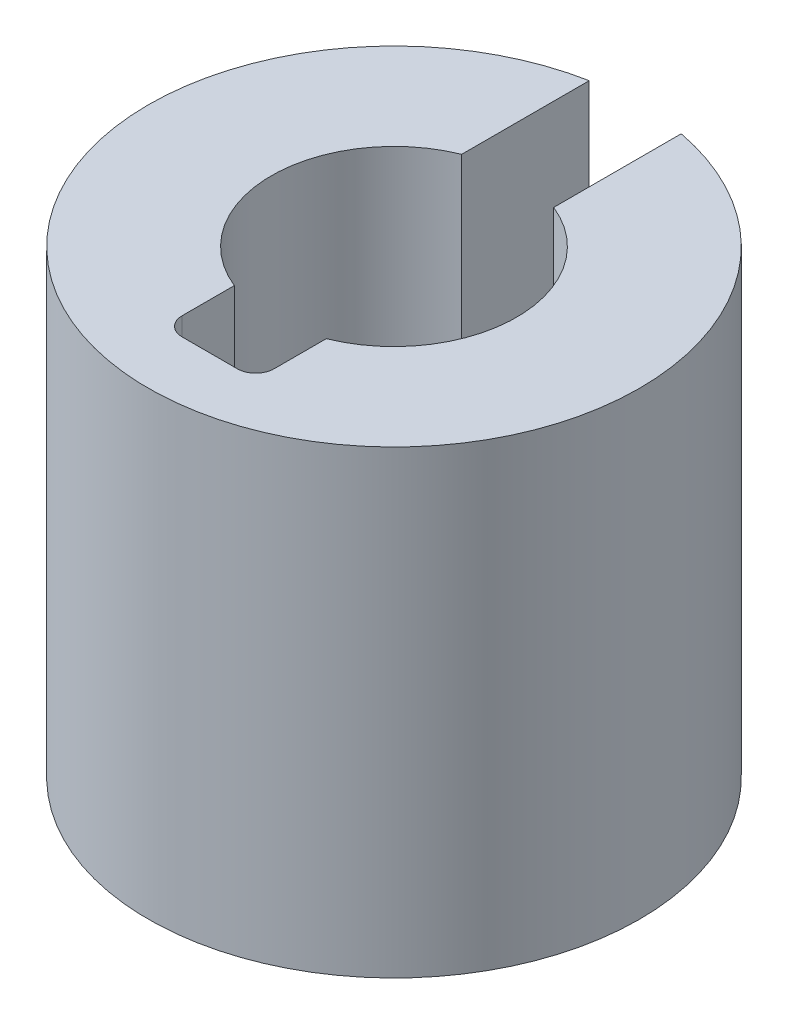
ISO-10303-21;
HEADER;
FILE_DESCRIPTION(('STEP AP214'),'2;1');
FILE_NAME('part.step','',(''),(''),'','','');
FILE_SCHEMA(('AUTOMOTIVE_DESIGN { 1 0 10303 214 1 1 1 1 }'));
ENDSEC;
DATA;
#1=APPLICATION_CONTEXT('core data for automotive mechanical design processes');
#2=APPLICATION_PROTOCOL_DEFINITION('international standard','automotive_design',2000,#1);
#3=PRODUCT_CONTEXT('',#1,'mechanical');
#4=PRODUCT('Part','Part','',(#3));
#5=PRODUCT_RELATED_PRODUCT_CATEGORY('part','',(#4));
#6=PRODUCT_DEFINITION_FORMATION('','',#4);
#7=PRODUCT_DEFINITION_CONTEXT('part definition',#1,'design');
#8=PRODUCT_DEFINITION('design','',#6,#7);
#9=PRODUCT_DEFINITION_SHAPE('','',#8);
#10=(LENGTH_UNIT() NAMED_UNIT(*) SI_UNIT(.MILLI.,.METRE.));
#11=(NAMED_UNIT(*) PLANE_ANGLE_UNIT() SI_UNIT($,.RADIAN.));
#12=(NAMED_UNIT(*) SI_UNIT($,.STERADIAN.) SOLID_ANGLE_UNIT());
#13=UNCERTAINTY_MEASURE_WITH_UNIT(LENGTH_MEASURE(1.E-05),#10,'distance_accuracy_value','');
#14=(GEOMETRIC_REPRESENTATION_CONTEXT(3) GLOBAL_UNCERTAINTY_ASSIGNED_CONTEXT((#13)) GLOBAL_UNIT_ASSIGNED_CONTEXT((#10,
#11,#12)) REPRESENTATION_CONTEXT('',''));
#15=CARTESIAN_POINT('',(0.,0.,0.));
#16=DIRECTION('',(0.,0.,1.));
#17=DIRECTION('',(1.,0.,0.));
#18=AXIS2_PLACEMENT_3D('',#15,#16,#17);
#19=CARTESIAN_POINT('',(-0.75,3.75,3.005));
#20=DIRECTION('',(0.,0.,1.));
#21=DIRECTION('',(1.,0.,0.));
#22=AXIS2_PLACEMENT_3D('',#19,#20,#21);
#23=PLANE('',#22);
#24=DIRECTION('',(0.,1.,0.));
#25=VECTOR('',#24,1.);
#26=CARTESIAN_POINT('',(-0.45,3.75,3.005));
#27=LINE('',#26,#25);
#28=CARTESIAN_POINT('',(-0.45,-3.75,3.005));
#29=VERTEX_POINT('',#28);
#30=CARTESIAN_POINT('',(-0.45,3.75,3.005));
#31=VERTEX_POINT('',#30);
#32=EDGE_CURVE('E145',#29,#31,#27,.T.);
#33=ORIENTED_EDGE('',*,*,#32,.T.);
#34=DIRECTION('',(1.,0.,0.));
#35=VECTOR('',#34,1.);
#36=CARTESIAN_POINT('',(-0.75,3.75,3.005));
#37=LINE('',#36,#35);
#38=CARTESIAN_POINT('',(0.45,3.75,3.005));
#39=VERTEX_POINT('',#38);
#40=EDGE_CURVE('E124',#39,#31,#37,.F.);
#41=ORIENTED_EDGE('',*,*,#40,.F.);
#42=DIRECTION('',(0.,1.,0.));
#43=VECTOR('',#42,1.);
#44=CARTESIAN_POINT('',(0.45,3.75,3.005));
#45=LINE('',#44,#43);
#46=CARTESIAN_POINT('',(0.45,-3.75,3.005));
#47=VERTEX_POINT('',#46);
#48=EDGE_CURVE('E123',#39,#47,#45,.F.);
#49=ORIENTED_EDGE('',*,*,#48,.T.);
#50=DIRECTION('',(1.,0.,0.));
#51=VECTOR('',#50,1.);
#52=CARTESIAN_POINT('',(-0.75,-3.75,3.005));
#53=LINE('',#52,#51);
#54=EDGE_CURVE('E112',#29,#47,#53,.T.);
#55=ORIENTED_EDGE('',*,*,#54,.F.);
#56=EDGE_LOOP('',(#33,#41,#49,#55));
#57=FACE_BOUND('',#56,.T.);
#58=ADVANCED_FACE('F16',(#57),#23,.F.);
#59=CARTESIAN_POINT('',(0.45,3.75,2.705));
#60=DIRECTION('',(0.,1.,0.));
#61=DIRECTION('',(0.,0.,1.));
#62=AXIS2_PLACEMENT_3D('',#59,#60,#61);
#63=CYLINDRICAL_SURFACE('',#62,0.3);
#64=DIRECTION('',(0.,1.,0.));
#65=VECTOR('',#64,1.);
#66=CARTESIAN_POINT('',(0.75,3.75,2.705));
#67=LINE('',#66,#65);
#68=CARTESIAN_POINT('',(0.75,3.75,2.705));
#69=VERTEX_POINT('',#68);
#70=CARTESIAN_POINT('',(0.75,-3.75,2.705));
#71=VERTEX_POINT('',#70);
#72=EDGE_CURVE('E134',#69,#71,#67,.F.);
#73=ORIENTED_EDGE('',*,*,#72,.T.);
#74=CARTESIAN_POINT('',(0.45,-3.75,2.705));
#75=DIRECTION('',(0.,1.,0.));
#76=DIRECTION('',(0.,0.,1.));
#77=AXIS2_PLACEMENT_3D('',#74,#75,#76);
#78=CIRCLE('',#77,0.3);
#79=EDGE_CURVE('E19',#47,#71,#78,.T.);
#80=ORIENTED_EDGE('',*,*,#79,.F.);
#81=ORIENTED_EDGE('',*,*,#48,.F.);
#82=CARTESIAN_POINT('',(0.45,3.75,2.705));
#83=DIRECTION('',(0.,1.,0.));
#84=DIRECTION('',(0.,0.,1.));
#85=AXIS2_PLACEMENT_3D('',#82,#83,#84);
#86=CIRCLE('',#85,0.3);
#87=EDGE_CURVE('E137',#69,#39,#86,.F.);
#88=ORIENTED_EDGE('',*,*,#87,.F.);
#89=EDGE_LOOP('',(#73,#80,#81,#88));
#90=FACE_BOUND('',#89,.T.);
#91=ADVANCED_FACE('F132',(#90),#63,.F.);
#92=CARTESIAN_POINT('',(-0.45,3.75,2.705));
#93=DIRECTION('',(0.,1.,0.));
#94=DIRECTION('',(0.,0.,1.));
#95=AXIS2_PLACEMENT_3D('',#92,#93,#94);
#96=CYLINDRICAL_SURFACE('',#95,0.3);
#97=ORIENTED_EDGE('',*,*,#32,.F.);
#98=CARTESIAN_POINT('',(-0.45,-3.75,2.705));
#99=DIRECTION('',(0.,1.,0.));
#100=DIRECTION('',(0.,0.,1.));
#101=AXIS2_PLACEMENT_3D('',#98,#99,#100);
#102=CIRCLE('',#101,0.3);
#103=CARTESIAN_POINT('',(-0.75,-3.75,2.705));
#104=VERTEX_POINT('',#103);
#105=EDGE_CURVE('E118',#104,#29,#102,.T.);
#106=ORIENTED_EDGE('',*,*,#105,.F.);
#107=DIRECTION('',(0.,1.,0.));
#108=VECTOR('',#107,1.);
#109=CARTESIAN_POINT('',(-0.75,3.75,2.705));
#110=LINE('',#109,#108);
#111=CARTESIAN_POINT('',(-0.75,3.75,2.705));
#112=VERTEX_POINT('',#111);
#113=EDGE_CURVE('E183',#104,#112,#110,.T.);
#114=ORIENTED_EDGE('',*,*,#113,.T.);
#115=CARTESIAN_POINT('',(-0.45,3.75,2.705));
#116=DIRECTION('',(0.,1.,0.));
#117=DIRECTION('',(0.,0.,1.));
#118=AXIS2_PLACEMENT_3D('',#115,#116,#117);
#119=CIRCLE('',#118,0.3);
#120=EDGE_CURVE('E148',#31,#112,#119,.F.);
#121=ORIENTED_EDGE('',*,*,#120,.F.);
#122=EDGE_LOOP('',(#97,#106,#114,#121));
#123=FACE_BOUND('',#122,.T.);
#124=ADVANCED_FACE('F234',(#123),#96,.F.);
#125=CARTESIAN_POINT('',(0.75,3.75,3.005));
#126=DIRECTION('',(1.,0.,0.));
#127=DIRECTION('',(0.,0.,-1.));
#128=AXIS2_PLACEMENT_3D('',#125,#126,#127);
#129=PLANE('',#128);
#130=ORIENTED_EDGE('',*,*,#72,.F.);
#131=DIRECTION('',(0.,0.,-1.));
#132=VECTOR('',#131,1.);
#133=CARTESIAN_POINT('',(0.75,3.75,3.005));
#134=LINE('',#133,#132);
#135=CARTESIAN_POINT('',(0.75,3.75,1.85404962177392));
#136=VERTEX_POINT('',#135);
#137=EDGE_CURVE('E151',#136,#69,#134,.F.);
#138=ORIENTED_EDGE('',*,*,#137,.F.);
#139=DIRECTION('',(0.,-1.,0.));
#140=VECTOR('',#139,1.);
#141=CARTESIAN_POINT('',(0.75,3.75,1.85404962177392));
#142=LINE('',#141,#140);
#143=CARTESIAN_POINT('',(0.75,-3.75,1.85404962177392));
#144=VERTEX_POINT('',#143);
#145=EDGE_CURVE('E195',#136,#144,#142,.T.);
#146=ORIENTED_EDGE('',*,*,#145,.T.);
#147=DIRECTION('',(0.,0.,-1.));
#148=VECTOR('',#147,1.);
#149=CARTESIAN_POINT('',(0.75,-3.75,3.005));
#150=LINE('',#149,#148);
#151=EDGE_CURVE('E182',#71,#144,#150,.T.);
#152=ORIENTED_EDGE('',*,*,#151,.F.);
#153=EDGE_LOOP('',(#130,#138,#146,#152));
#154=FACE_BOUND('',#153,.T.);
#155=ADVANCED_FACE('F231',(#154),#129,.F.);
#156=CARTESIAN_POINT('',(-0.75,3.75,3.005));
#157=DIRECTION('',(-1.,0.,0.));
#158=DIRECTION('',(0.,0.,1.));
#159=AXIS2_PLACEMENT_3D('',#156,#157,#158);
#160=PLANE('',#159);
#161=ORIENTED_EDGE('',*,*,#113,.F.);
#162=DIRECTION('',(0.,0.,1.));
#163=VECTOR('',#162,1.);
#164=CARTESIAN_POINT('',(-0.75,-3.75,3.005));
#165=LINE('',#164,#163);
#166=CARTESIAN_POINT('',(-0.75,-3.75,1.85404962177392));
#167=VERTEX_POINT('',#166);
#168=EDGE_CURVE('E188',#167,#104,#165,.T.);
#169=ORIENTED_EDGE('',*,*,#168,.F.);
#170=DIRECTION('',(0.,-1.,0.));
#171=VECTOR('',#170,1.);
#172=CARTESIAN_POINT('',(-0.749999999999999,3.75,1.85404962177392));
#173=LINE('',#172,#171);
#174=CARTESIAN_POINT('',(-0.75,3.75,1.85404962177392));
#175=VERTEX_POINT('',#174);
#176=EDGE_CURVE('E156',#167,#175,#173,.F.);
#177=ORIENTED_EDGE('',*,*,#176,.T.);
#178=DIRECTION('',(0.,0.,1.));
#179=VECTOR('',#178,1.);
#180=CARTESIAN_POINT('',(-0.75,3.75,3.005));
#181=LINE('',#180,#179);
#182=EDGE_CURVE('E187',#112,#175,#181,.F.);
#183=ORIENTED_EDGE('',*,*,#182,.F.);
#184=EDGE_LOOP('',(#161,#169,#177,#183));
#185=FACE_BOUND('',#184,.T.);
#186=ADVANCED_FACE('F233',(#185),#160,.F.);
#187=CARTESIAN_POINT('',(0.,3.75,0.));
#188=DIRECTION('',(0.,-1.,0.));
#189=DIRECTION('',(0.,0.,-1.));
#190=AXIS2_PLACEMENT_3D('',#187,#188,#189);
#191=CYLINDRICAL_SURFACE('',#190,2.);
#192=ORIENTED_EDGE('',*,*,#145,.F.);
#193=CARTESIAN_POINT('',(0.,3.75,0.));
#194=DIRECTION('',(0.,-1.,0.));
#195=DIRECTION('',(0.,0.,-1.));
#196=AXIS2_PLACEMENT_3D('',#193,#194,#195);
#197=CIRCLE('',#196,2.);
#198=CARTESIAN_POINT('',(0.75,3.75,-1.85404962177392));
#199=VERTEX_POINT('',#198);
#200=EDGE_CURVE('E160',#199,#136,#197,.T.);
#201=ORIENTED_EDGE('',*,*,#200,.F.);
#202=DIRECTION('',(0.,1.,0.));
#203=VECTOR('',#202,1.);
#204=CARTESIAN_POINT('',(0.75,3.75,-1.85404962177392));
#205=LINE('',#204,#203);
#206=CARTESIAN_POINT('',(0.75,-3.75,-1.85404962177392));
#207=VERTEX_POINT('',#206);
#208=EDGE_CURVE('E159',#199,#207,#205,.F.);
#209=ORIENTED_EDGE('',*,*,#208,.T.);
#210=CARTESIAN_POINT('',(0.,-3.75,0.));
#211=DIRECTION('',(0.,-1.,0.));
#212=DIRECTION('',(0.,0.,-1.));
#213=AXIS2_PLACEMENT_3D('',#210,#211,#212);
#214=CIRCLE('',#213,2.);
#215=EDGE_CURVE('E155',#207,#144,#214,.T.);
#216=ORIENTED_EDGE('',*,*,#215,.T.);
#217=EDGE_LOOP('',(#192,#201,#209,#216));
#218=FACE_BOUND('',#217,.T.);
#219=ADVANCED_FACE('F229',(#218),#191,.F.);
#220=CARTESIAN_POINT('',(0.,3.75,0.));
#221=DIRECTION('',(0.,-1.,0.));
#222=DIRECTION('',(0.,0.,-1.));
#223=AXIS2_PLACEMENT_3D('',#220,#221,#222);
#224=CYLINDRICAL_SURFACE('',#223,2.);
#225=DIRECTION('',(0.,1.,0.));
#226=VECTOR('',#225,1.);
#227=CARTESIAN_POINT('',(-0.75,3.75,-1.85404962177392));
#228=LINE('',#227,#226);
#229=CARTESIAN_POINT('',(-0.75,-3.75,-1.85404962177392));
#230=VERTEX_POINT('',#229);
#231=CARTESIAN_POINT('',(-0.75,3.75,-1.85404962177392));
#232=VERTEX_POINT('',#231);
#233=EDGE_CURVE('E206',#230,#232,#228,.T.);
#234=ORIENTED_EDGE('',*,*,#233,.T.);
#235=CARTESIAN_POINT('',(0.,3.75,0.));
#236=DIRECTION('',(0.,-1.,0.));
#237=DIRECTION('',(0.,0.,-1.));
#238=AXIS2_PLACEMENT_3D('',#235,#236,#237);
#239=CIRCLE('',#238,2.);
#240=EDGE_CURVE('E163',#175,#232,#239,.T.);
#241=ORIENTED_EDGE('',*,*,#240,.F.);
#242=ORIENTED_EDGE('',*,*,#176,.F.);
#243=CARTESIAN_POINT('',(0.,-3.75,0.));
#244=DIRECTION('',(0.,-1.,0.));
#245=DIRECTION('',(0.,0.,-1.));
#246=AXIS2_PLACEMENT_3D('',#243,#244,#245);
#247=CIRCLE('',#246,2.);
#248=EDGE_CURVE('E152',#167,#230,#247,.T.);
#249=ORIENTED_EDGE('',*,*,#248,.T.);
#250=EDGE_LOOP('',(#234,#241,#242,#249));
#251=FACE_BOUND('',#250,.T.);
#252=ADVANCED_FACE('F262',(#251),#224,.F.);
#253=CARTESIAN_POINT('',(0.,-3.75,0.));
#254=DIRECTION('',(0.,1.,0.));
#255=DIRECTION('',(0.,0.,1.));
#256=AXIS2_PLACEMENT_3D('',#253,#254,#255);
#257=PLANE('',#256);
#258=DIRECTION('',(0.,0.,-1.));
#259=VECTOR('',#258,1.);
#260=CARTESIAN_POINT('',(0.75,-3.75,-1.85404962177392));
#261=LINE('',#260,#259);
#262=CARTESIAN_POINT('',(0.75,-3.75,-3.9341485737069));
#263=VERTEX_POINT('',#262);
#264=EDGE_CURVE('E164',#207,#263,#261,.T.);
#265=ORIENTED_EDGE('',*,*,#264,.T.);
#266=CARTESIAN_POINT('',(0.,-3.75,0.));
#267=DIRECTION('',(0.,-1.,0.));
#268=DIRECTION('',(0.,0.,-1.));
#269=AXIS2_PLACEMENT_3D('',#266,#267,#268);
#270=CIRCLE('',#269,4.005);
#271=CARTESIAN_POINT('',(-0.75,-3.75,-3.9341485737069));
#272=VERTEX_POINT('',#271);
#273=EDGE_CURVE('E168',#272,#263,#270,.F.);
#274=ORIENTED_EDGE('',*,*,#273,.F.);
#275=DIRECTION('',(0.,0.,1.));
#276=VECTOR('',#275,1.);
#277=CARTESIAN_POINT('',(-0.75,-3.75,-1.85404962177392));
#278=LINE('',#277,#276);
#279=EDGE_CURVE('E173',#272,#230,#278,.T.);
#280=ORIENTED_EDGE('',*,*,#279,.T.);
#281=ORIENTED_EDGE('',*,*,#248,.F.);
#282=ORIENTED_EDGE('',*,*,#168,.T.);
#283=ORIENTED_EDGE('',*,*,#105,.T.);
#284=ORIENTED_EDGE('',*,*,#54,.T.);
#285=ORIENTED_EDGE('',*,*,#79,.T.);
#286=ORIENTED_EDGE('',*,*,#151,.T.);
#287=ORIENTED_EDGE('',*,*,#215,.F.);
#288=EDGE_LOOP('',(#265,#274,#280,#281,#282,#283,#284,#285,#286,#287));
#289=FACE_BOUND('',#288,.T.);
#290=ADVANCED_FACE('F114',(#289),#257,.F.);
#291=CARTESIAN_POINT('',(0.75,3.75,-1.85404962177392));
#292=DIRECTION('',(1.,0.,0.));
#293=DIRECTION('',(0.,0.,-1.));
#294=AXIS2_PLACEMENT_3D('',#291,#292,#293);
#295=PLANE('',#294);
#296=ORIENTED_EDGE('',*,*,#208,.F.);
#297=DIRECTION('',(0.,0.,1.));
#298=VECTOR('',#297,1.);
#299=CARTESIAN_POINT('',(0.75,3.75,0.));
#300=LINE('',#299,#298);
#301=CARTESIAN_POINT('',(0.75,3.75,-3.9341485737069));
#302=VERTEX_POINT('',#301);
#303=EDGE_CURVE('E167',#302,#199,#300,.T.);
#304=ORIENTED_EDGE('',*,*,#303,.F.);
#305=DIRECTION('',(0.,-1.,0.));
#306=VECTOR('',#305,1.);
#307=CARTESIAN_POINT('',(0.75,3.75,-3.9341485737069));
#308=LINE('',#307,#306);
#309=EDGE_CURVE('E172',#263,#302,#308,.F.);
#310=ORIENTED_EDGE('',*,*,#309,.F.);
#311=ORIENTED_EDGE('',*,*,#264,.F.);
#312=EDGE_LOOP('',(#296,#304,#310,#311));
#313=FACE_BOUND('',#312,.T.);
#314=ADVANCED_FACE('F224',(#313),#295,.F.);
#315=CARTESIAN_POINT('',(0.,3.75,0.));
#316=DIRECTION('',(0.,1.,0.));
#317=DIRECTION('',(0.,0.,1.));
#318=AXIS2_PLACEMENT_3D('',#315,#316,#317);
#319=PLANE('',#318);
#320=CARTESIAN_POINT('',(0.,3.75,0.));
#321=DIRECTION('',(0.,-1.,0.));
#322=DIRECTION('',(0.,0.,-1.));
#323=AXIS2_PLACEMENT_3D('',#320,#321,#322);
#324=CIRCLE('',#323,4.005);
#325=CARTESIAN_POINT('',(-0.75,3.75,-3.9341485737069));
#326=VERTEX_POINT('',#325);
#327=EDGE_CURVE('E26',#302,#326,#324,.T.);
#328=ORIENTED_EDGE('',*,*,#327,.F.);
#329=ORIENTED_EDGE('',*,*,#303,.T.);
#330=ORIENTED_EDGE('',*,*,#200,.T.);
#331=ORIENTED_EDGE('',*,*,#137,.T.);
#332=ORIENTED_EDGE('',*,*,#87,.T.);
#333=ORIENTED_EDGE('',*,*,#40,.T.);
#334=ORIENTED_EDGE('',*,*,#120,.T.);
#335=ORIENTED_EDGE('',*,*,#182,.T.);
#336=ORIENTED_EDGE('',*,*,#240,.T.);
#337=DIRECTION('',(0.,0.,1.));
#338=VECTOR('',#337,1.);
#339=CARTESIAN_POINT('',(-0.75,3.75,-1.85404962177392));
#340=LINE('',#339,#338);
#341=EDGE_CURVE('E39',#232,#326,#340,.F.);
#342=ORIENTED_EDGE('',*,*,#341,.T.);
#343=EDGE_LOOP('',(#328,#329,#330,#331,#332,#333,#334,#335,#336,#342));
#344=FACE_BOUND('',#343,.T.);
#345=ADVANCED_FACE('F220',(#344),#319,.T.);
#346=CARTESIAN_POINT('',(-0.75,3.75,-1.85404962177392));
#347=DIRECTION('',(-1.,0.,0.));
#348=DIRECTION('',(0.,0.,1.));
#349=AXIS2_PLACEMENT_3D('',#346,#347,#348);
#350=PLANE('',#349);
#351=DIRECTION('',(0.,-1.,0.));
#352=VECTOR('',#351,1.);
#353=CARTESIAN_POINT('',(-0.75,3.75,-3.9341485737069));
#354=LINE('',#353,#352);
#355=EDGE_CURVE('E11',#326,#272,#354,.T.);
#356=ORIENTED_EDGE('',*,*,#355,.F.);
#357=ORIENTED_EDGE('',*,*,#341,.F.);
#358=ORIENTED_EDGE('',*,*,#233,.F.);
#359=ORIENTED_EDGE('',*,*,#279,.F.);
#360=EDGE_LOOP('',(#356,#357,#358,#359));
#361=FACE_BOUND('',#360,.T.);
#362=ADVANCED_FACE('F247',(#361),#350,.F.);
#363=CARTESIAN_POINT('',(0.,3.75,0.));
#364=DIRECTION('',(0.,-1.,0.));
#365=DIRECTION('',(0.,0.,-1.));
#366=AXIS2_PLACEMENT_3D('',#363,#364,#365);
#367=CYLINDRICAL_SURFACE('',#366,4.005);
#368=ORIENTED_EDGE('',*,*,#327,.T.);
#369=ORIENTED_EDGE('',*,*,#355,.T.);
#370=ORIENTED_EDGE('',*,*,#273,.T.);
#371=ORIENTED_EDGE('',*,*,#309,.T.);
#372=EDGE_LOOP('',(#368,#369,#370,#371));
#373=FACE_BOUND('',#372,.T.);
#374=ADVANCED_FACE('F245',(#373),#367,.T.);
#375=CLOSED_SHELL('',(#58,#91,#124,#155,#186,#219,#252,#290,#314,#345,#362,#374));
#376=MANIFOLD_SOLID_BREP('B1',#375);
#377=ADVANCED_BREP_SHAPE_REPRESENTATION('',(#18,#376),#14);
#378=SHAPE_DEFINITION_REPRESENTATION(#9,#377);
ENDSEC;
END-ISO-10303-21;
